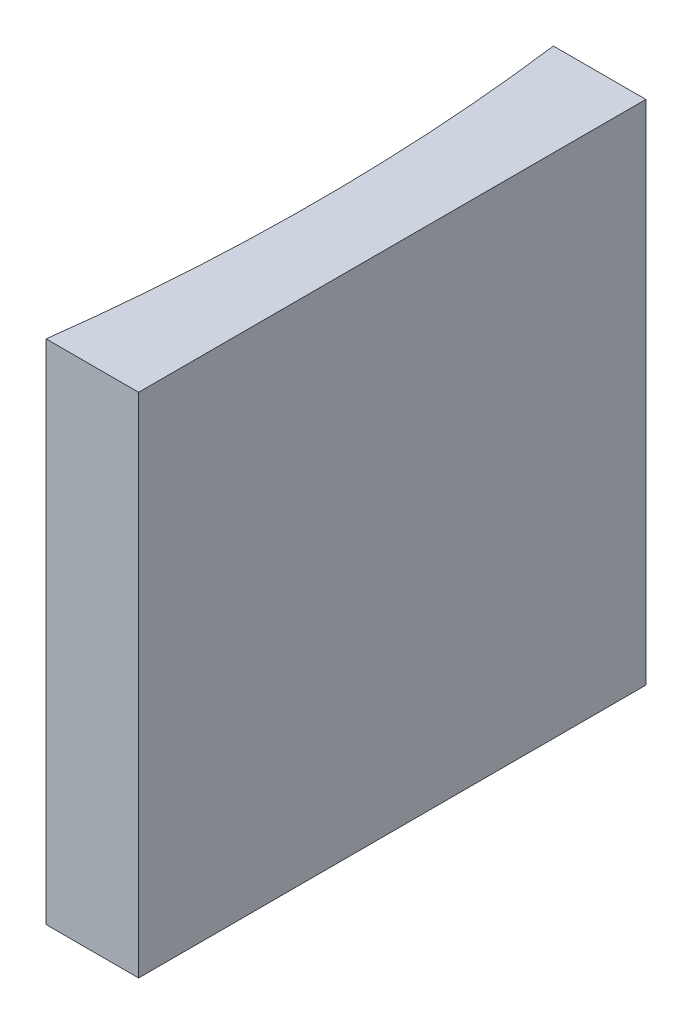
ISO-10303-21;
HEADER;
FILE_DESCRIPTION(('STEP AP214'),'2;1');
FILE_NAME('part.step','',(''),(''),'','','');
FILE_SCHEMA(('AUTOMOTIVE_DESIGN { 1 0 10303 214 1 1 1 1 }'));
ENDSEC;
DATA;
#1=APPLICATION_CONTEXT('core data for automotive mechanical design processes');
#2=APPLICATION_PROTOCOL_DEFINITION('international standard','automotive_design',2000,#1);
#3=PRODUCT_CONTEXT('',#1,'mechanical');
#4=PRODUCT('Part','Part','',(#3));
#5=PRODUCT_RELATED_PRODUCT_CATEGORY('part','',(#4));
#6=PRODUCT_DEFINITION_FORMATION('','',#4);
#7=PRODUCT_DEFINITION_CONTEXT('part definition',#1,'design');
#8=PRODUCT_DEFINITION('design','',#6,#7);
#9=PRODUCT_DEFINITION_SHAPE('','',#8);
#10=(LENGTH_UNIT() NAMED_UNIT(*) SI_UNIT(.MILLI.,.METRE.));
#11=(NAMED_UNIT(*) PLANE_ANGLE_UNIT() SI_UNIT($,.RADIAN.));
#12=(NAMED_UNIT(*) SI_UNIT($,.STERADIAN.) SOLID_ANGLE_UNIT());
#13=UNCERTAINTY_MEASURE_WITH_UNIT(LENGTH_MEASURE(1.E-05),#10,'distance_accuracy_value','');
#14=(GEOMETRIC_REPRESENTATION_CONTEXT(3) GLOBAL_UNCERTAINTY_ASSIGNED_CONTEXT((#13)) GLOBAL_UNIT_ASSIGNED_CONTEXT((#10,
#11,#12)) REPRESENTATION_CONTEXT('',''));
#15=CARTESIAN_POINT('',(0.,0.,0.));
#16=DIRECTION('',(0.,0.,1.));
#17=DIRECTION('',(1.,0.,0.));
#18=AXIS2_PLACEMENT_3D('',#15,#16,#17);
#19=CARTESIAN_POINT('',(0.,20.,0.));
#20=DIRECTION('',(0.,0.,1.));
#21=DIRECTION('',(1.,0.,0.));
#22=AXIS2_PLACEMENT_3D('',#19,#20,#21);
#23=PLANE('',#22);
#24=DIRECTION('',(-1.,0.,0.));
#25=VECTOR('',#24,1.);
#26=CARTESIAN_POINT('',(0.,0.,0.));
#27=LINE('',#26,#25);
#28=CARTESIAN_POINT('',(0.,0.,0.));
#29=VERTEX_POINT('',#28);
#30=CARTESIAN_POINT('',(-3.64744802673971,0.,0.));
#31=VERTEX_POINT('',#30);
#32=EDGE_CURVE('E100',#29,#31,#27,.T.);
#33=ORIENTED_EDGE('',*,*,#32,.T.);
#34=DIRECTION('',(0.,-1.,0.));
#35=VECTOR('',#34,1.);
#36=CARTESIAN_POINT('',(-3.64744802673971,20.,0.));
#37=LINE('',#36,#35);
#38=CARTESIAN_POINT('',(-3.64744802673971,20.,0.));
#39=VERTEX_POINT('',#38);
#40=EDGE_CURVE('E11',#39,#31,#37,.T.);
#41=ORIENTED_EDGE('',*,*,#40,.F.);
#42=DIRECTION('',(-1.,0.,0.));
#43=VECTOR('',#42,1.);
#44=CARTESIAN_POINT('',(0.,20.,0.));
#45=LINE('',#44,#43);
#46=CARTESIAN_POINT('',(0.,20.,0.));
#47=VERTEX_POINT('',#46);
#48=EDGE_CURVE('E88',#47,#39,#45,.T.);
#49=ORIENTED_EDGE('',*,*,#48,.F.);
#50=DIRECTION('',(0.,-1.,0.));
#51=VECTOR('',#50,1.);
#52=CARTESIAN_POINT('',(0.,20.,0.));
#53=LINE('',#52,#51);
#54=EDGE_CURVE('E96',#47,#29,#53,.T.);
#55=ORIENTED_EDGE('',*,*,#54,.T.);
#56=EDGE_LOOP('',(#33,#41,#49,#55));
#57=FACE_BOUND('',#56,.T.);
#58=ADVANCED_FACE('F37',(#57),#23,.F.);
#59=CARTESIAN_POINT('',(-80.55,20.,10.));
#60=DIRECTION('',(0.,-1.,0.));
#61=DIRECTION('',(0.,0.,-1.));
#62=AXIS2_PLACEMENT_3D('',#59,#60,#61);
#63=CYLINDRICAL_SURFACE('',#62,77.55);
#64=CARTESIAN_POINT('',(-80.55,0.,10.));
#65=DIRECTION('',(0.,-1.,0.));
#66=DIRECTION('',(0.,0.,1.));
#67=AXIS2_PLACEMENT_3D('',#64,#65,#66);
#68=CIRCLE('',#67,77.55);
#69=CARTESIAN_POINT('',(-3.6474480267397,0.,20.));
#70=VERTEX_POINT('',#69);
#71=EDGE_CURVE('E92',#31,#70,#68,.T.);
#72=ORIENTED_EDGE('',*,*,#71,.T.);
#73=DIRECTION('',(0.,-1.,0.));
#74=VECTOR('',#73,1.);
#75=CARTESIAN_POINT('',(-3.6474480267397,20.,20.));
#76=LINE('',#75,#74);
#77=CARTESIAN_POINT('',(-3.6474480267397,20.,20.));
#78=VERTEX_POINT('',#77);
#79=EDGE_CURVE('E45',#78,#70,#76,.T.);
#80=ORIENTED_EDGE('',*,*,#79,.F.);
#81=CARTESIAN_POINT('',(-80.55,20.,10.));
#82=DIRECTION('',(0.,-1.,0.));
#83=DIRECTION('',(0.,0.,1.));
#84=AXIS2_PLACEMENT_3D('',#81,#82,#83);
#85=CIRCLE('',#84,77.55);
#86=EDGE_CURVE('E83',#39,#78,#85,.T.);
#87=ORIENTED_EDGE('',*,*,#86,.F.);
#88=ORIENTED_EDGE('',*,*,#40,.T.);
#89=EDGE_LOOP('',(#72,#80,#87,#88));
#90=FACE_BOUND('',#89,.T.);
#91=ADVANCED_FACE('F91',(#90),#63,.F.);
#92=CARTESIAN_POINT('',(0.,20.,20.));
#93=DIRECTION('',(0.,0.,-1.));
#94=DIRECTION('',(-1.,0.,0.));
#95=AXIS2_PLACEMENT_3D('',#92,#93,#94);
#96=PLANE('',#95);
#97=DIRECTION('',(1.,0.,0.));
#98=VECTOR('',#97,1.);
#99=CARTESIAN_POINT('',(0.,0.,20.));
#100=LINE('',#99,#98);
#101=CARTESIAN_POINT('',(0.,0.,20.));
#102=VERTEX_POINT('',#101);
#103=EDGE_CURVE('E70',#70,#102,#100,.T.);
#104=ORIENTED_EDGE('',*,*,#103,.T.);
#105=DIRECTION('',(0.,-1.,0.));
#106=VECTOR('',#105,1.);
#107=CARTESIAN_POINT('',(0.,20.,20.));
#108=LINE('',#107,#106);
#109=CARTESIAN_POINT('',(0.,20.,20.));
#110=VERTEX_POINT('',#109);
#111=EDGE_CURVE('E93',#110,#102,#108,.T.);
#112=ORIENTED_EDGE('',*,*,#111,.F.);
#113=DIRECTION('',(1.,0.,0.));
#114=VECTOR('',#113,1.);
#115=CARTESIAN_POINT('',(0.,20.,20.));
#116=LINE('',#115,#114);
#117=EDGE_CURVE('E86',#78,#110,#116,.T.);
#118=ORIENTED_EDGE('',*,*,#117,.F.);
#119=ORIENTED_EDGE('',*,*,#79,.T.);
#120=EDGE_LOOP('',(#104,#112,#118,#119));
#121=FACE_BOUND('',#120,.T.);
#122=ADVANCED_FACE('F94',(#121),#96,.F.);
#123=CARTESIAN_POINT('',(0.,20.,0.));
#124=DIRECTION('',(-1.,0.,0.));
#125=DIRECTION('',(0.,0.,1.));
#126=AXIS2_PLACEMENT_3D('',#123,#124,#125);
#127=PLANE('',#126);
#128=DIRECTION('',(0.,0.,-1.));
#129=VECTOR('',#128,1.);
#130=CARTESIAN_POINT('',(0.,0.,0.));
#131=LINE('',#130,#129);
#132=EDGE_CURVE('E76',#102,#29,#131,.T.);
#133=ORIENTED_EDGE('',*,*,#132,.T.);
#134=ORIENTED_EDGE('',*,*,#54,.F.);
#135=DIRECTION('',(0.,0.,-1.));
#136=VECTOR('',#135,1.);
#137=CARTESIAN_POINT('',(0.,20.,0.));
#138=LINE('',#137,#136);
#139=EDGE_CURVE('E53',#110,#47,#138,.T.);
#140=ORIENTED_EDGE('',*,*,#139,.F.);
#141=ORIENTED_EDGE('',*,*,#111,.T.);
#142=EDGE_LOOP('',(#133,#134,#140,#141));
#143=FACE_BOUND('',#142,.T.);
#144=ADVANCED_FACE('F107',(#143),#127,.F.);
#145=CARTESIAN_POINT('',(-80.55,20.,10.));
#146=DIRECTION('',(0.,1.,0.));
#147=DIRECTION('',(0.,0.,1.));
#148=AXIS2_PLACEMENT_3D('',#145,#146,#147);
#149=PLANE('',#148);
#150=ORIENTED_EDGE('',*,*,#48,.T.);
#151=ORIENTED_EDGE('',*,*,#86,.T.);
#152=ORIENTED_EDGE('',*,*,#117,.T.);
#153=ORIENTED_EDGE('',*,*,#139,.T.);
#154=EDGE_LOOP('',(#150,#151,#152,#153));
#155=FACE_BOUND('',#154,.T.);
#156=ADVANCED_FACE('F84',(#155),#149,.T.);
#157=CARTESIAN_POINT('',(-80.55,0.,10.));
#158=DIRECTION('',(0.,1.,0.));
#159=DIRECTION('',(0.,0.,1.));
#160=AXIS2_PLACEMENT_3D('',#157,#158,#159);
#161=PLANE('',#160);
#162=ORIENTED_EDGE('',*,*,#32,.F.);
#163=ORIENTED_EDGE('',*,*,#132,.F.);
#164=ORIENTED_EDGE('',*,*,#103,.F.);
#165=ORIENTED_EDGE('',*,*,#71,.F.);
#166=EDGE_LOOP('',(#162,#163,#164,#165));
#167=FACE_BOUND('',#166,.T.);
#168=ADVANCED_FACE('F110',(#167),#161,.F.);
#169=CLOSED_SHELL('',(#58,#91,#122,#144,#156,#168));
#170=MANIFOLD_SOLID_BREP('B2',#169);
#171=ADVANCED_BREP_SHAPE_REPRESENTATION('',(#18,#170),#14);
#172=SHAPE_DEFINITION_REPRESENTATION(#9,#171);
ENDSEC;
END-ISO-10303-21;
